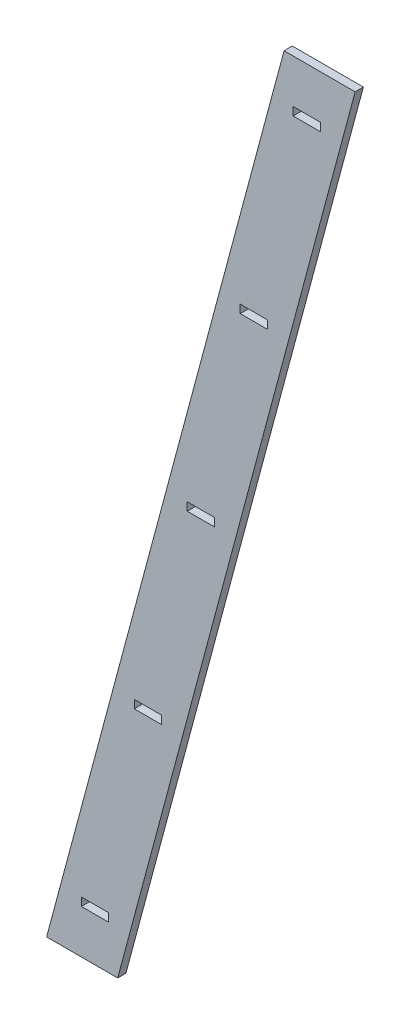
ISO-10303-21;
HEADER;
FILE_DESCRIPTION(('STEP AP214'),'2;1');
FILE_NAME('part.step','',(''),(''),'','','');
FILE_SCHEMA(('AUTOMOTIVE_DESIGN { 1 0 10303 214 1 1 1 1 }'));
ENDSEC;
DATA;
#1=APPLICATION_CONTEXT('core data for automotive mechanical design processes');
#2=APPLICATION_PROTOCOL_DEFINITION('international standard','automotive_design',2000,#1);
#3=PRODUCT_CONTEXT('',#1,'mechanical');
#4=PRODUCT('Part','Part','',(#3));
#5=PRODUCT_RELATED_PRODUCT_CATEGORY('part','',(#4));
#6=PRODUCT_DEFINITION_FORMATION('','',#4);
#7=PRODUCT_DEFINITION_CONTEXT('part definition',#1,'design');
#8=PRODUCT_DEFINITION('design','',#6,#7);
#9=PRODUCT_DEFINITION_SHAPE('','',#8);
#10=(LENGTH_UNIT() NAMED_UNIT(*) SI_UNIT(.MILLI.,.METRE.));
#11=(NAMED_UNIT(*) PLANE_ANGLE_UNIT() SI_UNIT($,.RADIAN.));
#12=(NAMED_UNIT(*) SI_UNIT($,.STERADIAN.) SOLID_ANGLE_UNIT());
#13=UNCERTAINTY_MEASURE_WITH_UNIT(LENGTH_MEASURE(1.E-05),#10,'distance_accuracy_value','');
#14=(GEOMETRIC_REPRESENTATION_CONTEXT(3) GLOBAL_UNCERTAINTY_ASSIGNED_CONTEXT((#13)) GLOBAL_UNIT_ASSIGNED_CONTEXT((#10,
#11,#12)) REPRESENTATION_CONTEXT('',''));
#15=CARTESIAN_POINT('',(0.,0.,0.));
#16=DIRECTION('',(0.,0.,1.));
#17=DIRECTION('',(1.,0.,0.));
#18=AXIS2_PLACEMENT_3D('',#15,#16,#17);
#19=CARTESIAN_POINT('',(0.,0.,15.));
#20=DIRECTION('',(0.,0.,-1.));
#21=DIRECTION('',(-1.,0.,0.));
#22=AXIS2_PLACEMENT_3D('',#19,#20,#21);
#23=PLANE('',#22);
#24=DIRECTION('',(0.,1.,0.));
#25=VECTOR('',#24,1.);
#26=CARTESIAN_POINT('',(121.796645765745,353.75,15.));
#27=LINE('',#26,#25);
#28=CARTESIAN_POINT('',(121.796645765745,353.75,15.));
#29=VERTEX_POINT('',#28);
#30=CARTESIAN_POINT('',(121.796645765745,368.75,15.));
#31=VERTEX_POINT('',#30);
#32=EDGE_CURVE('E249',#29,#31,#27,.T.);
#33=ORIENTED_EDGE('',*,*,#32,.F.);
#34=DIRECTION('',(1.,0.,0.));
#35=VECTOR('',#34,1.);
#36=CARTESIAN_POINT('',(71.7966457657447,353.75,15.));
#37=LINE('',#36,#35);
#38=CARTESIAN_POINT('',(71.7966457657447,353.75,15.));
#39=VERTEX_POINT('',#38);
#40=EDGE_CURVE('E260',#39,#29,#37,.T.);
#41=ORIENTED_EDGE('',*,*,#40,.F.);
#42=DIRECTION('',(0.,-1.,0.));
#43=VECTOR('',#42,1.);
#44=CARTESIAN_POINT('',(71.7966457657447,353.75,15.));
#45=LINE('',#44,#43);
#46=CARTESIAN_POINT('',(71.7966457657447,368.75,15.));
#47=VERTEX_POINT('',#46);
#48=EDGE_CURVE('E256',#47,#39,#45,.T.);
#49=ORIENTED_EDGE('',*,*,#48,.F.);
#50=DIRECTION('',(-1.,0.,0.));
#51=VECTOR('',#50,1.);
#52=CARTESIAN_POINT('',(71.7966457657447,368.75,15.));
#53=LINE('',#52,#51);
#54=EDGE_CURVE('E252',#31,#47,#53,.T.);
#55=ORIENTED_EDGE('',*,*,#54,.F.);
#56=EDGE_LOOP('',(#33,#41,#49,#55));
#57=FACE_BOUND('',#56,.T.);
#58=DIRECTION('',(0.,1.,0.));
#59=VECTOR('',#58,1.);
#60=CARTESIAN_POINT('',(-168.593291531489,-729.999999999999,15.));
#61=LINE('',#60,#59);
#62=CARTESIAN_POINT('',(-168.593291531489,-729.999999999999,15.));
#63=VERTEX_POINT('',#62);
#64=CARTESIAN_POINT('',(-168.593291531489,-714.999999999999,15.));
#65=VERTEX_POINT('',#64);
#66=EDGE_CURVE('E335',#63,#65,#61,.T.);
#67=ORIENTED_EDGE('',*,*,#66,.F.);
#68=DIRECTION('',(1.,0.,0.));
#69=VECTOR('',#68,1.);
#70=CARTESIAN_POINT('',(-218.593291531489,-729.999999999999,15.));
#71=LINE('',#70,#69);
#72=CARTESIAN_POINT('',(-218.593291531489,-729.999999999999,15.));
#73=VERTEX_POINT('',#72);
#74=EDGE_CURVE('E346',#73,#63,#71,.T.);
#75=ORIENTED_EDGE('',*,*,#74,.F.);
#76=DIRECTION('',(0.,-1.,0.));
#77=VECTOR('',#76,1.);
#78=CARTESIAN_POINT('',(-218.593291531489,-729.999999999999,15.));
#79=LINE('',#78,#77);
#80=CARTESIAN_POINT('',(-218.593291531489,-714.999999999999,15.));
#81=VERTEX_POINT('',#80);
#82=EDGE_CURVE('E342',#81,#73,#79,.T.);
#83=ORIENTED_EDGE('',*,*,#82,.F.);
#84=DIRECTION('',(-1.,0.,0.));
#85=VECTOR('',#84,1.);
#86=CARTESIAN_POINT('',(-218.593291531489,-714.999999999999,15.));
#87=LINE('',#86,#85);
#88=EDGE_CURVE('E338',#65,#81,#87,.T.);
#89=ORIENTED_EDGE('',*,*,#88,.F.);
#90=EDGE_LOOP('',(#67,#75,#83,#89));
#91=FACE_BOUND('',#90,.T.);
#92=DIRECTION('',(1.,0.,0.));
#93=VECTOR('',#92,1.);
#94=CARTESIAN_POINT('',(-282.038845869213,-809.999999999999,15.));
#95=LINE('',#94,#93);
#96=CARTESIAN_POINT('',(-282.038845869213,-809.999999999999,15.));
#97=VERTEX_POINT('',#96);
#98=CARTESIAN_POINT('',(-152.038845869213,-809.999999999999,15.));
#99=VERTEX_POINT('',#98);
#100=EDGE_CURVE('E421',#97,#99,#95,.T.);
#101=ORIENTED_EDGE('',*,*,#100,.T.);
#102=DIRECTION('',(0.258819045102525,0.965925826289067,0.));
#103=VECTOR('',#102,1.);
#104=CARTESIAN_POINT('',(273.330497115201,777.5,15.));
#105=LINE('',#104,#103);
#106=CARTESIAN_POINT('',(282.038845869213,810.000000000001,15.));
#107=VERTEX_POINT('',#106);
#108=EDGE_CURVE('E425',#99,#107,#105,.T.);
#109=ORIENTED_EDGE('',*,*,#108,.T.);
#110=DIRECTION('',(-1.,0.,0.));
#111=VECTOR('',#110,1.);
#112=CARTESIAN_POINT('',(282.038845869213,810.000000000001,15.));
#113=LINE('',#112,#111);
#114=CARTESIAN_POINT('',(152.038845869213,810.000000000001,15.));
#115=VERTEX_POINT('',#114);
#116=EDGE_CURVE('E429',#107,#115,#113,.T.);
#117=ORIENTED_EDGE('',*,*,#116,.T.);
#118=DIRECTION('',(-0.258819045102525,-0.965925826289067,0.));
#119=VECTOR('',#118,1.);
#120=CARTESIAN_POINT('',(152.038845869213,810.000000000001,15.));
#121=LINE('',#120,#119);
#122=EDGE_CURVE('E432',#115,#97,#121,.T.);
#123=ORIENTED_EDGE('',*,*,#122,.T.);
#124=EDGE_LOOP('',(#101,#109,#117,#123));
#125=FACE_BOUND('',#124,.T.);
#126=DIRECTION('',(0.,1.,0.));
#127=VECTOR('',#126,1.);
#128=CARTESIAN_POINT('',(25.,-7.5,15.));
#129=LINE('',#128,#127);
#130=CARTESIAN_POINT('',(25.,-7.5,15.));
#131=VERTEX_POINT('',#130);
#132=CARTESIAN_POINT('',(25.,7.5,15.));
#133=VERTEX_POINT('',#132);
#134=EDGE_CURVE('E378',#131,#133,#129,.T.);
#135=ORIENTED_EDGE('',*,*,#134,.F.);
#136=DIRECTION('',(1.,0.,0.));
#137=VECTOR('',#136,1.);
#138=CARTESIAN_POINT('',(-25.,-7.5,15.));
#139=LINE('',#138,#137);
#140=CARTESIAN_POINT('',(-25.,-7.5,15.));
#141=VERTEX_POINT('',#140);
#142=EDGE_CURVE('E389',#141,#131,#139,.T.);
#143=ORIENTED_EDGE('',*,*,#142,.F.);
#144=DIRECTION('',(0.,-1.,0.));
#145=VECTOR('',#144,1.);
#146=CARTESIAN_POINT('',(-25.,-7.5,15.));
#147=LINE('',#146,#145);
#148=CARTESIAN_POINT('',(-25.,7.5,15.));
#149=VERTEX_POINT('',#148);
#150=EDGE_CURVE('E385',#149,#141,#147,.T.);
#151=ORIENTED_EDGE('',*,*,#150,.F.);
#152=DIRECTION('',(-1.,0.,0.));
#153=VECTOR('',#152,1.);
#154=CARTESIAN_POINT('',(-25.,7.5,15.));
#155=LINE('',#154,#153);
#156=EDGE_CURVE('E381',#133,#149,#155,.T.);
#157=ORIENTED_EDGE('',*,*,#156,.F.);
#158=EDGE_LOOP('',(#135,#143,#151,#157));
#159=FACE_BOUND('',#158,.T.);
#160=DIRECTION('',(0.,1.,0.));
#161=VECTOR('',#160,1.);
#162=CARTESIAN_POINT('',(-71.7966457657444,-368.75,15.));
#163=LINE('',#162,#161);
#164=CARTESIAN_POINT('',(-71.7966457657444,-368.75,15.));
#165=VERTEX_POINT('',#164);
#166=CARTESIAN_POINT('',(-71.7966457657444,-353.75,15.));
#167=VERTEX_POINT('',#166);
#168=EDGE_CURVE('E292',#165,#167,#163,.T.);
#169=ORIENTED_EDGE('',*,*,#168,.F.);
#170=DIRECTION('',(1.,0.,0.));
#171=VECTOR('',#170,1.);
#172=CARTESIAN_POINT('',(-121.796645765744,-368.75,15.));
#173=LINE('',#172,#171);
#174=CARTESIAN_POINT('',(-121.796645765744,-368.75,15.));
#175=VERTEX_POINT('',#174);
#176=EDGE_CURVE('E303',#175,#165,#173,.T.);
#177=ORIENTED_EDGE('',*,*,#176,.F.);
#178=DIRECTION('',(0.,-1.,0.));
#179=VECTOR('',#178,1.);
#180=CARTESIAN_POINT('',(-121.796645765744,-368.75,15.));
#181=LINE('',#180,#179);
#182=CARTESIAN_POINT('',(-121.796645765744,-353.75,15.));
#183=VERTEX_POINT('',#182);
#184=EDGE_CURVE('E299',#183,#175,#181,.T.);
#185=ORIENTED_EDGE('',*,*,#184,.F.);
#186=DIRECTION('',(-1.,0.,0.));
#187=VECTOR('',#186,1.);
#188=CARTESIAN_POINT('',(-121.796645765744,-353.75,15.));
#189=LINE('',#188,#187);
#190=EDGE_CURVE('E295',#167,#183,#189,.T.);
#191=ORIENTED_EDGE('',*,*,#190,.F.);
#192=EDGE_LOOP('',(#169,#177,#185,#191));
#193=FACE_BOUND('',#192,.T.);
#194=DIRECTION('',(0.,1.,0.));
#195=VECTOR('',#194,1.);
#196=CARTESIAN_POINT('',(218.59329153149,715.000000000001,15.));
#197=LINE('',#196,#195);
#198=CARTESIAN_POINT('',(218.59329153149,715.000000000001,15.));
#199=VERTEX_POINT('',#198);
#200=CARTESIAN_POINT('',(218.59329153149,730.000000000001,15.));
#201=VERTEX_POINT('',#200);
#202=EDGE_CURVE('E201',#199,#201,#197,.T.);
#203=ORIENTED_EDGE('',*,*,#202,.F.);
#204=DIRECTION('',(1.,0.,0.));
#205=VECTOR('',#204,1.);
#206=CARTESIAN_POINT('',(168.59329153149,715.000000000001,15.));
#207=LINE('',#206,#205);
#208=CARTESIAN_POINT('',(168.59329153149,715.000000000001,15.));
#209=VERTEX_POINT('',#208);
#210=EDGE_CURVE('E227',#209,#199,#207,.T.);
#211=ORIENTED_EDGE('',*,*,#210,.F.);
#212=DIRECTION('',(0.,-1.,0.));
#213=VECTOR('',#212,1.);
#214=CARTESIAN_POINT('',(168.59329153149,715.000000000001,15.));
#215=LINE('',#214,#213);
#216=CARTESIAN_POINT('',(168.59329153149,730.000000000001,15.));
#217=VERTEX_POINT('',#216);
#218=EDGE_CURVE('E223',#217,#209,#215,.T.);
#219=ORIENTED_EDGE('',*,*,#218,.F.);
#220=DIRECTION('',(-1.,0.,0.));
#221=VECTOR('',#220,1.);
#222=CARTESIAN_POINT('',(168.59329153149,730.000000000001,15.));
#223=LINE('',#222,#221);
#224=EDGE_CURVE('E210',#201,#217,#223,.T.);
#225=ORIENTED_EDGE('',*,*,#224,.F.);
#226=EDGE_LOOP('',(#203,#211,#219,#225));
#227=FACE_BOUND('',#226,.T.);
#228=ADVANCED_FACE('F39',(#57,#91,#125,#159,#193,#227),#23,.F.);
#229=CARTESIAN_POINT('',(0.,0.,0.));
#230=DIRECTION('',(0.,0.,-1.));
#231=DIRECTION('',(-1.,0.,0.));
#232=AXIS2_PLACEMENT_3D('',#229,#230,#231);
#233=PLANE('',#232);
#234=DIRECTION('',(1.,0.,0.));
#235=VECTOR('',#234,1.);
#236=CARTESIAN_POINT('',(-282.038845869213,-809.999999999999,0.));
#237=LINE('',#236,#235);
#238=CARTESIAN_POINT('',(-282.038845869213,-809.999999999999,0.));
#239=VERTEX_POINT('',#238);
#240=CARTESIAN_POINT('',(-152.038845869213,-809.999999999999,0.));
#241=VERTEX_POINT('',#240);
#242=EDGE_CURVE('E420',#239,#241,#237,.T.);
#243=ORIENTED_EDGE('',*,*,#242,.F.);
#244=DIRECTION('',(-0.258819045102524,-0.965925826289067,0.));
#245=VECTOR('',#244,1.);
#246=CARTESIAN_POINT('',(-273.330497115201,-777.499999999999,0.));
#247=LINE('',#246,#245);
#248=CARTESIAN_POINT('',(152.038845869213,810.000000000001,0.));
#249=VERTEX_POINT('',#248);
#250=EDGE_CURVE('E426',#249,#239,#247,.T.);
#251=ORIENTED_EDGE('',*,*,#250,.F.);
#252=DIRECTION('',(-1.,0.,0.));
#253=VECTOR('',#252,1.);
#254=CARTESIAN_POINT('',(282.038845869213,810.000000000001,0.));
#255=LINE('',#254,#253);
#256=CARTESIAN_POINT('',(282.038845869213,810.000000000001,0.));
#257=VERTEX_POINT('',#256);
#258=EDGE_CURVE('E442',#257,#249,#255,.T.);
#259=ORIENTED_EDGE('',*,*,#258,.F.);
#260=DIRECTION('',(0.258819045102525,0.965925826289067,0.));
#261=VECTOR('',#260,1.);
#262=CARTESIAN_POINT('',(273.330497115201,777.5,0.));
#263=LINE('',#262,#261);
#264=EDGE_CURVE('E439',#241,#257,#263,.T.);
#265=ORIENTED_EDGE('',*,*,#264,.F.);
#266=EDGE_LOOP('',(#243,#251,#259,#265));
#267=FACE_BOUND('',#266,.T.);
#268=DIRECTION('',(1.,0.,0.));
#269=VECTOR('',#268,1.);
#270=CARTESIAN_POINT('',(-25.,-7.5,0.));
#271=LINE('',#270,#269);
#272=CARTESIAN_POINT('',(-25.,-7.5,0.));
#273=VERTEX_POINT('',#272);
#274=CARTESIAN_POINT('',(25.,-7.5,0.));
#275=VERTEX_POINT('',#274);
#276=EDGE_CURVE('E382',#273,#275,#271,.T.);
#277=ORIENTED_EDGE('',*,*,#276,.T.);
#278=DIRECTION('',(0.,1.,0.));
#279=VECTOR('',#278,1.);
#280=CARTESIAN_POINT('',(25.,-7.5,0.));
#281=LINE('',#280,#279);
#282=CARTESIAN_POINT('',(25.,7.5,0.));
#283=VERTEX_POINT('',#282);
#284=EDGE_CURVE('E377',#275,#283,#281,.T.);
#285=ORIENTED_EDGE('',*,*,#284,.T.);
#286=DIRECTION('',(-1.,0.,0.));
#287=VECTOR('',#286,1.);
#288=CARTESIAN_POINT('',(-25.,7.5,0.));
#289=LINE('',#288,#287);
#290=CARTESIAN_POINT('',(-25.,7.5,0.));
#291=VERTEX_POINT('',#290);
#292=EDGE_CURVE('E396',#283,#291,#289,.T.);
#293=ORIENTED_EDGE('',*,*,#292,.T.);
#294=DIRECTION('',(0.,-1.,0.));
#295=VECTOR('',#294,1.);
#296=CARTESIAN_POINT('',(-25.,-7.5,0.));
#297=LINE('',#296,#295);
#298=EDGE_CURVE('E400',#291,#273,#297,.T.);
#299=ORIENTED_EDGE('',*,*,#298,.T.);
#300=EDGE_LOOP('',(#277,#285,#293,#299));
#301=FACE_BOUND('',#300,.T.);
#302=DIRECTION('',(1.,0.,0.));
#303=VECTOR('',#302,1.);
#304=CARTESIAN_POINT('',(-218.593291531489,-729.999999999999,0.));
#305=LINE('',#304,#303);
#306=CARTESIAN_POINT('',(-218.593291531489,-729.999999999999,0.));
#307=VERTEX_POINT('',#306);
#308=CARTESIAN_POINT('',(-168.593291531489,-729.999999999999,0.));
#309=VERTEX_POINT('',#308);
#310=EDGE_CURVE('E339',#307,#309,#305,.T.);
#311=ORIENTED_EDGE('',*,*,#310,.T.);
#312=DIRECTION('',(0.,1.,0.));
#313=VECTOR('',#312,1.);
#314=CARTESIAN_POINT('',(-168.593291531489,-729.999999999999,0.));
#315=LINE('',#314,#313);
#316=CARTESIAN_POINT('',(-168.593291531489,-714.999999999999,0.));
#317=VERTEX_POINT('',#316);
#318=EDGE_CURVE('E334',#309,#317,#315,.T.);
#319=ORIENTED_EDGE('',*,*,#318,.T.);
#320=DIRECTION('',(-1.,0.,0.));
#321=VECTOR('',#320,1.);
#322=CARTESIAN_POINT('',(-218.593291531489,-714.999999999999,0.));
#323=LINE('',#322,#321);
#324=CARTESIAN_POINT('',(-218.593291531489,-714.999999999999,0.));
#325=VERTEX_POINT('',#324);
#326=EDGE_CURVE('E353',#317,#325,#323,.T.);
#327=ORIENTED_EDGE('',*,*,#326,.T.);
#328=DIRECTION('',(0.,-1.,0.));
#329=VECTOR('',#328,1.);
#330=CARTESIAN_POINT('',(-218.593291531489,-729.999999999999,0.));
#331=LINE('',#330,#329);
#332=EDGE_CURVE('E357',#325,#307,#331,.T.);
#333=ORIENTED_EDGE('',*,*,#332,.T.);
#334=EDGE_LOOP('',(#311,#319,#327,#333));
#335=FACE_BOUND('',#334,.T.);
#336=DIRECTION('',(1.,0.,0.));
#337=VECTOR('',#336,1.);
#338=CARTESIAN_POINT('',(-121.796645765744,-368.75,0.));
#339=LINE('',#338,#337);
#340=CARTESIAN_POINT('',(-121.796645765744,-368.75,0.));
#341=VERTEX_POINT('',#340);
#342=CARTESIAN_POINT('',(-71.7966457657444,-368.75,0.));
#343=VERTEX_POINT('',#342);
#344=EDGE_CURVE('E296',#341,#343,#339,.T.);
#345=ORIENTED_EDGE('',*,*,#344,.T.);
#346=DIRECTION('',(0.,1.,0.));
#347=VECTOR('',#346,1.);
#348=CARTESIAN_POINT('',(-71.7966457657444,-368.75,0.));
#349=LINE('',#348,#347);
#350=CARTESIAN_POINT('',(-71.7966457657444,-353.75,0.));
#351=VERTEX_POINT('',#350);
#352=EDGE_CURVE('E291',#343,#351,#349,.T.);
#353=ORIENTED_EDGE('',*,*,#352,.T.);
#354=DIRECTION('',(-1.,0.,0.));
#355=VECTOR('',#354,1.);
#356=CARTESIAN_POINT('',(-121.796645765744,-353.75,0.));
#357=LINE('',#356,#355);
#358=CARTESIAN_POINT('',(-121.796645765744,-353.75,0.));
#359=VERTEX_POINT('',#358);
#360=EDGE_CURVE('E310',#351,#359,#357,.T.);
#361=ORIENTED_EDGE('',*,*,#360,.T.);
#362=DIRECTION('',(0.,-1.,0.));
#363=VECTOR('',#362,1.);
#364=CARTESIAN_POINT('',(-121.796645765744,-368.75,0.));
#365=LINE('',#364,#363);
#366=EDGE_CURVE('E314',#359,#341,#365,.T.);
#367=ORIENTED_EDGE('',*,*,#366,.T.);
#368=EDGE_LOOP('',(#345,#353,#361,#367));
#369=FACE_BOUND('',#368,.T.);
#370=DIRECTION('',(1.,0.,0.));
#371=VECTOR('',#370,1.);
#372=CARTESIAN_POINT('',(71.7966457657447,353.75,0.));
#373=LINE('',#372,#371);
#374=CARTESIAN_POINT('',(71.7966457657447,353.75,0.));
#375=VERTEX_POINT('',#374);
#376=CARTESIAN_POINT('',(121.796645765745,353.75,0.));
#377=VERTEX_POINT('',#376);
#378=EDGE_CURVE('E253',#375,#377,#373,.T.);
#379=ORIENTED_EDGE('',*,*,#378,.T.);
#380=DIRECTION('',(0.,1.,0.));
#381=VECTOR('',#380,1.);
#382=CARTESIAN_POINT('',(121.796645765745,353.75,0.));
#383=LINE('',#382,#381);
#384=CARTESIAN_POINT('',(121.796645765745,368.75,0.));
#385=VERTEX_POINT('',#384);
#386=EDGE_CURVE('E219',#377,#385,#383,.T.);
#387=ORIENTED_EDGE('',*,*,#386,.T.);
#388=DIRECTION('',(-1.,0.,0.));
#389=VECTOR('',#388,1.);
#390=CARTESIAN_POINT('',(71.7966457657447,368.75,0.));
#391=LINE('',#390,#389);
#392=CARTESIAN_POINT('',(71.7966457657447,368.75,0.));
#393=VERTEX_POINT('',#392);
#394=EDGE_CURVE('E267',#385,#393,#391,.T.);
#395=ORIENTED_EDGE('',*,*,#394,.T.);
#396=DIRECTION('',(0.,-1.,0.));
#397=VECTOR('',#396,1.);
#398=CARTESIAN_POINT('',(71.7966457657447,353.75,0.));
#399=LINE('',#398,#397);
#400=EDGE_CURVE('E271',#393,#375,#399,.T.);
#401=ORIENTED_EDGE('',*,*,#400,.T.);
#402=EDGE_LOOP('',(#379,#387,#395,#401));
#403=FACE_BOUND('',#402,.T.);
#404=DIRECTION('',(1.,0.,0.));
#405=VECTOR('',#404,1.);
#406=CARTESIAN_POINT('',(168.59329153149,715.000000000001,0.));
#407=LINE('',#406,#405);
#408=CARTESIAN_POINT('',(168.59329153149,715.000000000001,0.));
#409=VERTEX_POINT('',#408);
#410=CARTESIAN_POINT('',(218.59329153149,715.000000000001,0.));
#411=VERTEX_POINT('',#410);
#412=EDGE_CURVE('E211',#409,#411,#407,.T.);
#413=ORIENTED_EDGE('',*,*,#412,.T.);
#414=DIRECTION('',(0.,1.,0.));
#415=VECTOR('',#414,1.);
#416=CARTESIAN_POINT('',(218.59329153149,715.000000000001,0.));
#417=LINE('',#416,#415);
#418=CARTESIAN_POINT('',(218.59329153149,730.000000000001,0.));
#419=VERTEX_POINT('',#418);
#420=EDGE_CURVE('E63',#411,#419,#417,.T.);
#421=ORIENTED_EDGE('',*,*,#420,.T.);
#422=DIRECTION('',(-1.,0.,0.));
#423=VECTOR('',#422,1.);
#424=CARTESIAN_POINT('',(168.59329153149,730.000000000001,0.));
#425=LINE('',#424,#423);
#426=CARTESIAN_POINT('',(168.59329153149,730.000000000001,0.));
#427=VERTEX_POINT('',#426);
#428=EDGE_CURVE('E217',#419,#427,#425,.T.);
#429=ORIENTED_EDGE('',*,*,#428,.T.);
#430=DIRECTION('',(0.,-1.,0.));
#431=VECTOR('',#430,1.);
#432=CARTESIAN_POINT('',(168.59329153149,715.000000000001,0.));
#433=LINE('',#432,#431);
#434=EDGE_CURVE('E236',#427,#409,#433,.T.);
#435=ORIENTED_EDGE('',*,*,#434,.T.);
#436=EDGE_LOOP('',(#413,#421,#429,#435));
#437=FACE_BOUND('',#436,.T.);
#438=ADVANCED_FACE('F465',(#267,#301,#335,#369,#403,#437),#233,.T.);
#439=CARTESIAN_POINT('',(-282.038845869213,-809.999999999999,15.));
#440=DIRECTION('',(0.,1.,0.));
#441=DIRECTION('',(0.,0.,1.));
#442=AXIS2_PLACEMENT_3D('',#439,#440,#441);
#443=PLANE('',#442);
#444=ORIENTED_EDGE('',*,*,#242,.T.);
#445=DIRECTION('',(0.,0.,-1.));
#446=VECTOR('',#445,1.);
#447=CARTESIAN_POINT('',(-152.038845869213,-809.999999999999,15.));
#448=LINE('',#447,#446);
#449=EDGE_CURVE('E11',#99,#241,#448,.T.);
#450=ORIENTED_EDGE('',*,*,#449,.F.);
#451=ORIENTED_EDGE('',*,*,#100,.F.);
#452=DIRECTION('',(0.,0.,-1.));
#453=VECTOR('',#452,1.);
#454=CARTESIAN_POINT('',(-282.038845869213,-809.999999999999,15.));
#455=LINE('',#454,#453);
#456=EDGE_CURVE('E435',#97,#239,#455,.T.);
#457=ORIENTED_EDGE('',*,*,#456,.T.);
#458=EDGE_LOOP('',(#444,#450,#451,#457));
#459=FACE_BOUND('',#458,.T.);
#460=ADVANCED_FACE('F41',(#459),#443,.F.);
#461=CARTESIAN_POINT('',(273.330497115201,777.5,15.));
#462=DIRECTION('',(-0.965925826289067,0.258819045102525,0.));
#463=DIRECTION('',(-0.258819045102525,-0.965925826289067,0.));
#464=AXIS2_PLACEMENT_3D('',#461,#462,#463);
#465=PLANE('',#464);
#466=ORIENTED_EDGE('',*,*,#264,.T.);
#467=DIRECTION('',(0.,0.,-1.));
#468=VECTOR('',#467,1.);
#469=CARTESIAN_POINT('',(282.038845869213,810.000000000001,15.));
#470=LINE('',#469,#468);
#471=EDGE_CURVE('E48',#107,#257,#470,.T.);
#472=ORIENTED_EDGE('',*,*,#471,.F.);
#473=ORIENTED_EDGE('',*,*,#108,.F.);
#474=ORIENTED_EDGE('',*,*,#449,.T.);
#475=EDGE_LOOP('',(#466,#472,#473,#474));
#476=FACE_BOUND('',#475,.T.);
#477=ADVANCED_FACE('F476',(#476),#465,.F.);
#478=CARTESIAN_POINT('',(282.038845869213,810.000000000001,15.));
#479=DIRECTION('',(0.,-1.,0.));
#480=DIRECTION('',(0.,0.,-1.));
#481=AXIS2_PLACEMENT_3D('',#478,#479,#480);
#482=PLANE('',#481);
#483=ORIENTED_EDGE('',*,*,#258,.T.);
#484=DIRECTION('',(0.,0.,-1.));
#485=VECTOR('',#484,1.);
#486=CARTESIAN_POINT('',(152.038845869213,810.000000000001,15.));
#487=LINE('',#486,#485);
#488=EDGE_CURVE('E451',#115,#249,#487,.T.);
#489=ORIENTED_EDGE('',*,*,#488,.F.);
#490=ORIENTED_EDGE('',*,*,#116,.F.);
#491=ORIENTED_EDGE('',*,*,#471,.T.);
#492=EDGE_LOOP('',(#483,#489,#490,#491));
#493=FACE_BOUND('',#492,.T.);
#494=ADVANCED_FACE('F460',(#493),#482,.F.);
#495=CARTESIAN_POINT('',(-273.330497115201,-777.499999999999,15.));
#496=DIRECTION('',(0.965925826289067,-0.258819045102524,0.));
#497=DIRECTION('',(0.258819045102524,0.965925826289067,0.));
#498=AXIS2_PLACEMENT_3D('',#495,#496,#497);
#499=PLANE('',#498);
#500=ORIENTED_EDGE('',*,*,#250,.T.);
#501=ORIENTED_EDGE('',*,*,#456,.F.);
#502=ORIENTED_EDGE('',*,*,#122,.F.);
#503=ORIENTED_EDGE('',*,*,#488,.T.);
#504=EDGE_LOOP('',(#500,#501,#502,#503));
#505=FACE_BOUND('',#504,.T.);
#506=ADVANCED_FACE('F469',(#505),#499,.F.);
#507=CARTESIAN_POINT('',(25.,-7.5,15.));
#508=DIRECTION('',(-1.,0.,0.));
#509=DIRECTION('',(0.,0.,1.));
#510=AXIS2_PLACEMENT_3D('',#507,#508,#509);
#511=PLANE('',#510);
#512=ORIENTED_EDGE('',*,*,#284,.F.);
#513=DIRECTION('',(0.,0.,-1.));
#514=VECTOR('',#513,1.);
#515=CARTESIAN_POINT('',(25.,-7.5,15.));
#516=LINE('',#515,#514);
#517=EDGE_CURVE('E392',#131,#275,#516,.T.);
#518=ORIENTED_EDGE('',*,*,#517,.F.);
#519=ORIENTED_EDGE('',*,*,#134,.T.);
#520=DIRECTION('',(0.,0.,-1.));
#521=VECTOR('',#520,1.);
#522=CARTESIAN_POINT('',(25.,7.5,15.));
#523=LINE('',#522,#521);
#524=EDGE_CURVE('E416',#133,#283,#523,.T.);
#525=ORIENTED_EDGE('',*,*,#524,.T.);
#526=EDGE_LOOP('',(#512,#518,#519,#525));
#527=FACE_BOUND('',#526,.T.);
#528=ADVANCED_FACE('F493',(#527),#511,.T.);
#529=CARTESIAN_POINT('',(-25.,7.5,15.));
#530=DIRECTION('',(0.,-1.,0.));
#531=DIRECTION('',(1.,0.,0.));
#532=AXIS2_PLACEMENT_3D('',#529,#530,#531);
#533=PLANE('',#532);
#534=ORIENTED_EDGE('',*,*,#292,.F.);
#535=ORIENTED_EDGE('',*,*,#524,.F.);
#536=ORIENTED_EDGE('',*,*,#156,.T.);
#537=DIRECTION('',(0.,0.,-1.));
#538=VECTOR('',#537,1.);
#539=CARTESIAN_POINT('',(-25.,7.5,15.));
#540=LINE('',#539,#538);
#541=EDGE_CURVE('E413',#149,#291,#540,.T.);
#542=ORIENTED_EDGE('',*,*,#541,.T.);
#543=EDGE_LOOP('',(#534,#535,#536,#542));
#544=FACE_BOUND('',#543,.T.);
#545=ADVANCED_FACE('F500',(#544),#533,.T.);
#546=CARTESIAN_POINT('',(-25.,-7.5,15.));
#547=DIRECTION('',(1.,0.,0.));
#548=DIRECTION('',(0.,0.,-1.));
#549=AXIS2_PLACEMENT_3D('',#546,#547,#548);
#550=PLANE('',#549);
#551=ORIENTED_EDGE('',*,*,#298,.F.);
#552=ORIENTED_EDGE('',*,*,#541,.F.);
#553=ORIENTED_EDGE('',*,*,#150,.T.);
#554=DIRECTION('',(0.,0.,-1.));
#555=VECTOR('',#554,1.);
#556=CARTESIAN_POINT('',(-25.,-7.5,15.));
#557=LINE('',#556,#555);
#558=EDGE_CURVE('E410',#141,#273,#557,.T.);
#559=ORIENTED_EDGE('',*,*,#558,.T.);
#560=EDGE_LOOP('',(#551,#552,#553,#559));
#561=FACE_BOUND('',#560,.T.);
#562=ADVANCED_FACE('F505',(#561),#550,.T.);
#563=CARTESIAN_POINT('',(-25.,-7.5,15.));
#564=DIRECTION('',(0.,1.,0.));
#565=DIRECTION('',(-1.,0.,0.));
#566=AXIS2_PLACEMENT_3D('',#563,#564,#565);
#567=PLANE('',#566);
#568=ORIENTED_EDGE('',*,*,#276,.F.);
#569=ORIENTED_EDGE('',*,*,#558,.F.);
#570=ORIENTED_EDGE('',*,*,#142,.T.);
#571=ORIENTED_EDGE('',*,*,#517,.T.);
#572=EDGE_LOOP('',(#568,#569,#570,#571));
#573=FACE_BOUND('',#572,.T.);
#574=ADVANCED_FACE('F512',(#573),#567,.T.);
#575=CARTESIAN_POINT('',(-168.593291531489,-729.999999999999,15.));
#576=DIRECTION('',(-1.,0.,0.));
#577=DIRECTION('',(0.,0.,1.));
#578=AXIS2_PLACEMENT_3D('',#575,#576,#577);
#579=PLANE('',#578);
#580=ORIENTED_EDGE('',*,*,#318,.F.);
#581=DIRECTION('',(0.,0.,-1.));
#582=VECTOR('',#581,1.);
#583=CARTESIAN_POINT('',(-168.593291531489,-729.999999999999,15.));
#584=LINE('',#583,#582);
#585=EDGE_CURVE('E349',#63,#309,#584,.T.);
#586=ORIENTED_EDGE('',*,*,#585,.F.);
#587=ORIENTED_EDGE('',*,*,#66,.T.);
#588=DIRECTION('',(0.,0.,-1.));
#589=VECTOR('',#588,1.);
#590=CARTESIAN_POINT('',(-168.593291531489,-714.999999999999,15.));
#591=LINE('',#590,#589);
#592=EDGE_CURVE('E373',#65,#317,#591,.T.);
#593=ORIENTED_EDGE('',*,*,#592,.T.);
#594=EDGE_LOOP('',(#580,#586,#587,#593));
#595=FACE_BOUND('',#594,.T.);
#596=ADVANCED_FACE('F564',(#595),#579,.T.);
#597=CARTESIAN_POINT('',(-218.593291531489,-714.999999999999,15.));
#598=DIRECTION('',(0.,-1.,0.));
#599=DIRECTION('',(0.,0.,-1.));
#600=AXIS2_PLACEMENT_3D('',#597,#598,#599);
#601=PLANE('',#600);
#602=ORIENTED_EDGE('',*,*,#326,.F.);
#603=ORIENTED_EDGE('',*,*,#592,.F.);
#604=ORIENTED_EDGE('',*,*,#88,.T.);
#605=DIRECTION('',(0.,0.,-1.));
#606=VECTOR('',#605,1.);
#607=CARTESIAN_POINT('',(-218.593291531489,-714.999999999999,15.));
#608=LINE('',#607,#606);
#609=EDGE_CURVE('E370',#81,#325,#608,.T.);
#610=ORIENTED_EDGE('',*,*,#609,.T.);
#611=EDGE_LOOP('',(#602,#603,#604,#610));
#612=FACE_BOUND('',#611,.T.);
#613=ADVANCED_FACE('F560',(#612),#601,.T.);
#614=CARTESIAN_POINT('',(-218.593291531489,-729.999999999999,15.));
#615=DIRECTION('',(1.,0.,0.));
#616=DIRECTION('',(0.,0.,-1.));
#617=AXIS2_PLACEMENT_3D('',#614,#615,#616);
#618=PLANE('',#617);
#619=ORIENTED_EDGE('',*,*,#332,.F.);
#620=ORIENTED_EDGE('',*,*,#609,.F.);
#621=ORIENTED_EDGE('',*,*,#82,.T.);
#622=DIRECTION('',(0.,0.,-1.));
#623=VECTOR('',#622,1.);
#624=CARTESIAN_POINT('',(-218.593291531489,-729.999999999999,15.));
#625=LINE('',#624,#623);
#626=EDGE_CURVE('E367',#73,#307,#625,.T.);
#627=ORIENTED_EDGE('',*,*,#626,.T.);
#628=EDGE_LOOP('',(#619,#620,#621,#627));
#629=FACE_BOUND('',#628,.T.);
#630=ADVANCED_FACE('F556',(#629),#618,.T.);
#631=CARTESIAN_POINT('',(-218.593291531489,-729.999999999999,15.));
#632=DIRECTION('',(0.,1.,0.));
#633=DIRECTION('',(0.,0.,1.));
#634=AXIS2_PLACEMENT_3D('',#631,#632,#633);
#635=PLANE('',#634);
#636=ORIENTED_EDGE('',*,*,#310,.F.);
#637=ORIENTED_EDGE('',*,*,#626,.F.);
#638=ORIENTED_EDGE('',*,*,#74,.T.);
#639=ORIENTED_EDGE('',*,*,#585,.T.);
#640=EDGE_LOOP('',(#636,#637,#638,#639));
#641=FACE_BOUND('',#640,.T.);
#642=ADVANCED_FACE('F553',(#641),#635,.T.);
#643=CARTESIAN_POINT('',(-71.7966457657444,-368.75,15.));
#644=DIRECTION('',(-1.,0.,0.));
#645=DIRECTION('',(0.,0.,1.));
#646=AXIS2_PLACEMENT_3D('',#643,#644,#645);
#647=PLANE('',#646);
#648=ORIENTED_EDGE('',*,*,#352,.F.);
#649=DIRECTION('',(0.,0.,-1.));
#650=VECTOR('',#649,1.);
#651=CARTESIAN_POINT('',(-71.7966457657444,-368.75,15.));
#652=LINE('',#651,#650);
#653=EDGE_CURVE('E306',#165,#343,#652,.T.);
#654=ORIENTED_EDGE('',*,*,#653,.F.);
#655=ORIENTED_EDGE('',*,*,#168,.T.);
#656=DIRECTION('',(0.,0.,-1.));
#657=VECTOR('',#656,1.);
#658=CARTESIAN_POINT('',(-71.7966457657444,-353.75,15.));
#659=LINE('',#658,#657);
#660=EDGE_CURVE('E330',#167,#351,#659,.T.);
#661=ORIENTED_EDGE('',*,*,#660,.T.);
#662=EDGE_LOOP('',(#648,#654,#655,#661));
#663=FACE_BOUND('',#662,.T.);
#664=ADVANCED_FACE('F528',(#663),#647,.T.);
#665=CARTESIAN_POINT('',(-121.796645765744,-353.75,15.));
#666=DIRECTION('',(0.,-1.,0.));
#667=DIRECTION('',(0.,0.,-1.));
#668=AXIS2_PLACEMENT_3D('',#665,#666,#667);
#669=PLANE('',#668);
#670=ORIENTED_EDGE('',*,*,#360,.F.);
#671=ORIENTED_EDGE('',*,*,#660,.F.);
#672=ORIENTED_EDGE('',*,*,#190,.T.);
#673=DIRECTION('',(0.,0.,-1.));
#674=VECTOR('',#673,1.);
#675=CARTESIAN_POINT('',(-121.796645765744,-353.75,15.));
#676=LINE('',#675,#674);
#677=EDGE_CURVE('E327',#183,#359,#676,.T.);
#678=ORIENTED_EDGE('',*,*,#677,.T.);
#679=EDGE_LOOP('',(#670,#671,#672,#678));
#680=FACE_BOUND('',#679,.T.);
#681=ADVANCED_FACE('F530',(#680),#669,.T.);
#682=CARTESIAN_POINT('',(-121.796645765744,-368.75,15.));
#683=DIRECTION('',(1.,0.,0.));
#684=DIRECTION('',(0.,0.,-1.));
#685=AXIS2_PLACEMENT_3D('',#682,#683,#684);
#686=PLANE('',#685);
#687=ORIENTED_EDGE('',*,*,#366,.F.);
#688=ORIENTED_EDGE('',*,*,#677,.F.);
#689=ORIENTED_EDGE('',*,*,#184,.T.);
#690=DIRECTION('',(0.,0.,-1.));
#691=VECTOR('',#690,1.);
#692=CARTESIAN_POINT('',(-121.796645765744,-368.75,15.));
#693=LINE('',#692,#691);
#694=EDGE_CURVE('E324',#175,#341,#693,.T.);
#695=ORIENTED_EDGE('',*,*,#694,.T.);
#696=EDGE_LOOP('',(#687,#688,#689,#695));
#697=FACE_BOUND('',#696,.T.);
#698=ADVANCED_FACE('F539',(#697),#686,.T.);
#699=CARTESIAN_POINT('',(-121.796645765744,-368.75,15.));
#700=DIRECTION('',(0.,1.,0.));
#701=DIRECTION('',(0.,0.,1.));
#702=AXIS2_PLACEMENT_3D('',#699,#700,#701);
#703=PLANE('',#702);
#704=ORIENTED_EDGE('',*,*,#344,.F.);
#705=ORIENTED_EDGE('',*,*,#694,.F.);
#706=ORIENTED_EDGE('',*,*,#176,.T.);
#707=ORIENTED_EDGE('',*,*,#653,.T.);
#708=EDGE_LOOP('',(#704,#705,#706,#707));
#709=FACE_BOUND('',#708,.T.);
#710=ADVANCED_FACE('F537',(#709),#703,.T.);
#711=CARTESIAN_POINT('',(121.796645765745,353.75,15.));
#712=DIRECTION('',(-1.,0.,0.));
#713=DIRECTION('',(0.,0.,1.));
#714=AXIS2_PLACEMENT_3D('',#711,#712,#713);
#715=PLANE('',#714);
#716=ORIENTED_EDGE('',*,*,#386,.F.);
#717=DIRECTION('',(0.,0.,-1.));
#718=VECTOR('',#717,1.);
#719=CARTESIAN_POINT('',(121.796645765745,353.75,15.));
#720=LINE('',#719,#718);
#721=EDGE_CURVE('E263',#29,#377,#720,.T.);
#722=ORIENTED_EDGE('',*,*,#721,.F.);
#723=ORIENTED_EDGE('',*,*,#32,.T.);
#724=DIRECTION('',(0.,0.,-1.));
#725=VECTOR('',#724,1.);
#726=CARTESIAN_POINT('',(121.796645765745,368.75,15.));
#727=LINE('',#726,#725);
#728=EDGE_CURVE('E287',#31,#385,#727,.T.);
#729=ORIENTED_EDGE('',*,*,#728,.T.);
#730=EDGE_LOOP('',(#716,#722,#723,#729));
#731=FACE_BOUND('',#730,.T.);
#732=ADVANCED_FACE('F546',(#731),#715,.T.);
#733=CARTESIAN_POINT('',(71.7966457657447,368.75,15.));
#734=DIRECTION('',(0.,-1.,0.));
#735=DIRECTION('',(0.,0.,-1.));
#736=AXIS2_PLACEMENT_3D('',#733,#734,#735);
#737=PLANE('',#736);
#738=ORIENTED_EDGE('',*,*,#394,.F.);
#739=ORIENTED_EDGE('',*,*,#728,.F.);
#740=ORIENTED_EDGE('',*,*,#54,.T.);
#741=DIRECTION('',(0.,0.,-1.));
#742=VECTOR('',#741,1.);
#743=CARTESIAN_POINT('',(71.7966457657447,368.75,15.));
#744=LINE('',#743,#742);
#745=EDGE_CURVE('E284',#47,#393,#744,.T.);
#746=ORIENTED_EDGE('',*,*,#745,.T.);
#747=EDGE_LOOP('',(#738,#739,#740,#746));
#748=FACE_BOUND('',#747,.T.);
#749=ADVANCED_FACE('F623',(#748),#737,.T.);
#750=CARTESIAN_POINT('',(71.7966457657447,353.75,15.));
#751=DIRECTION('',(1.,0.,0.));
#752=DIRECTION('',(0.,0.,-1.));
#753=AXIS2_PLACEMENT_3D('',#750,#751,#752);
#754=PLANE('',#753);
#755=ORIENTED_EDGE('',*,*,#400,.F.);
#756=ORIENTED_EDGE('',*,*,#745,.F.);
#757=ORIENTED_EDGE('',*,*,#48,.T.);
#758=DIRECTION('',(0.,0.,-1.));
#759=VECTOR('',#758,1.);
#760=CARTESIAN_POINT('',(71.7966457657447,353.75,15.));
#761=LINE('',#760,#759);
#762=EDGE_CURVE('E281',#39,#375,#761,.T.);
#763=ORIENTED_EDGE('',*,*,#762,.T.);
#764=EDGE_LOOP('',(#755,#756,#757,#763));
#765=FACE_BOUND('',#764,.T.);
#766=ADVANCED_FACE('F632',(#765),#754,.T.);
#767=CARTESIAN_POINT('',(71.7966457657447,353.75,15.));
#768=DIRECTION('',(0.,1.,0.));
#769=DIRECTION('',(0.,0.,1.));
#770=AXIS2_PLACEMENT_3D('',#767,#768,#769);
#771=PLANE('',#770);
#772=ORIENTED_EDGE('',*,*,#378,.F.);
#773=ORIENTED_EDGE('',*,*,#762,.F.);
#774=ORIENTED_EDGE('',*,*,#40,.T.);
#775=ORIENTED_EDGE('',*,*,#721,.T.);
#776=EDGE_LOOP('',(#772,#773,#774,#775));
#777=FACE_BOUND('',#776,.T.);
#778=ADVANCED_FACE('F642',(#777),#771,.T.);
#779=CARTESIAN_POINT('',(218.59329153149,715.000000000001,15.));
#780=DIRECTION('',(-1.,0.,0.));
#781=DIRECTION('',(0.,0.,1.));
#782=AXIS2_PLACEMENT_3D('',#779,#780,#781);
#783=PLANE('',#782);
#784=ORIENTED_EDGE('',*,*,#420,.F.);
#785=DIRECTION('',(0.,0.,-1.));
#786=VECTOR('',#785,1.);
#787=CARTESIAN_POINT('',(218.59329153149,715.000000000001,15.));
#788=LINE('',#787,#786);
#789=EDGE_CURVE('E205',#199,#411,#788,.T.);
#790=ORIENTED_EDGE('',*,*,#789,.F.);
#791=ORIENTED_EDGE('',*,*,#202,.T.);
#792=DIRECTION('',(0.,0.,-1.));
#793=VECTOR('',#792,1.);
#794=CARTESIAN_POINT('',(218.59329153149,730.000000000001,15.));
#795=LINE('',#794,#793);
#796=EDGE_CURVE('E204',#201,#419,#795,.T.);
#797=ORIENTED_EDGE('',*,*,#796,.T.);
#798=EDGE_LOOP('',(#784,#790,#791,#797));
#799=FACE_BOUND('',#798,.T.);
#800=ADVANCED_FACE('F203',(#799),#783,.T.);
#801=CARTESIAN_POINT('',(168.59329153149,730.000000000001,15.));
#802=DIRECTION('',(0.,-1.,0.));
#803=DIRECTION('',(0.,0.,-1.));
#804=AXIS2_PLACEMENT_3D('',#801,#802,#803);
#805=PLANE('',#804);
#806=ORIENTED_EDGE('',*,*,#428,.F.);
#807=ORIENTED_EDGE('',*,*,#796,.F.);
#808=ORIENTED_EDGE('',*,*,#224,.T.);
#809=DIRECTION('',(0.,0.,-1.));
#810=VECTOR('',#809,1.);
#811=CARTESIAN_POINT('',(168.59329153149,730.000000000001,15.));
#812=LINE('',#811,#810);
#813=EDGE_CURVE('E220',#217,#427,#812,.T.);
#814=ORIENTED_EDGE('',*,*,#813,.T.);
#815=EDGE_LOOP('',(#806,#807,#808,#814));
#816=FACE_BOUND('',#815,.T.);
#817=ADVANCED_FACE('F214',(#816),#805,.T.);
#818=CARTESIAN_POINT('',(168.59329153149,715.000000000001,15.));
#819=DIRECTION('',(1.,0.,0.));
#820=DIRECTION('',(0.,0.,-1.));
#821=AXIS2_PLACEMENT_3D('',#818,#819,#820);
#822=PLANE('',#821);
#823=ORIENTED_EDGE('',*,*,#434,.F.);
#824=ORIENTED_EDGE('',*,*,#813,.F.);
#825=ORIENTED_EDGE('',*,*,#218,.T.);
#826=DIRECTION('',(0.,0.,-1.));
#827=VECTOR('',#826,1.);
#828=CARTESIAN_POINT('',(168.59329153149,715.000000000001,15.));
#829=LINE('',#828,#827);
#830=EDGE_CURVE('E55',#209,#409,#829,.T.);
#831=ORIENTED_EDGE('',*,*,#830,.T.);
#832=EDGE_LOOP('',(#823,#824,#825,#831));
#833=FACE_BOUND('',#832,.T.);
#834=ADVANCED_FACE('F669',(#833),#822,.T.);
#835=CARTESIAN_POINT('',(168.59329153149,715.000000000001,15.));
#836=DIRECTION('',(0.,1.,0.));
#837=DIRECTION('',(0.,0.,1.));
#838=AXIS2_PLACEMENT_3D('',#835,#836,#837);
#839=PLANE('',#838);
#840=ORIENTED_EDGE('',*,*,#412,.F.);
#841=ORIENTED_EDGE('',*,*,#830,.F.);
#842=ORIENTED_EDGE('',*,*,#210,.T.);
#843=ORIENTED_EDGE('',*,*,#789,.T.);
#844=EDGE_LOOP('',(#840,#841,#842,#843));
#845=FACE_BOUND('',#844,.T.);
#846=ADVANCED_FACE('F678',(#845),#839,.T.);
#847=CLOSED_SHELL('',(#228,#438,#460,#477,#494,#506,#528,#545,#562,#574,#596,#613,#630,#642,
#664,#681,#698,#710,#732,#749,#766,#778,#800,#817,#834,#846));
#848=MANIFOLD_SOLID_BREP('B2',#847);
#849=ADVANCED_BREP_SHAPE_REPRESENTATION('',(#18,#848),#14);
#850=SHAPE_DEFINITION_REPRESENTATION(#9,#849);
ENDSEC;
END-ISO-10303-21;
